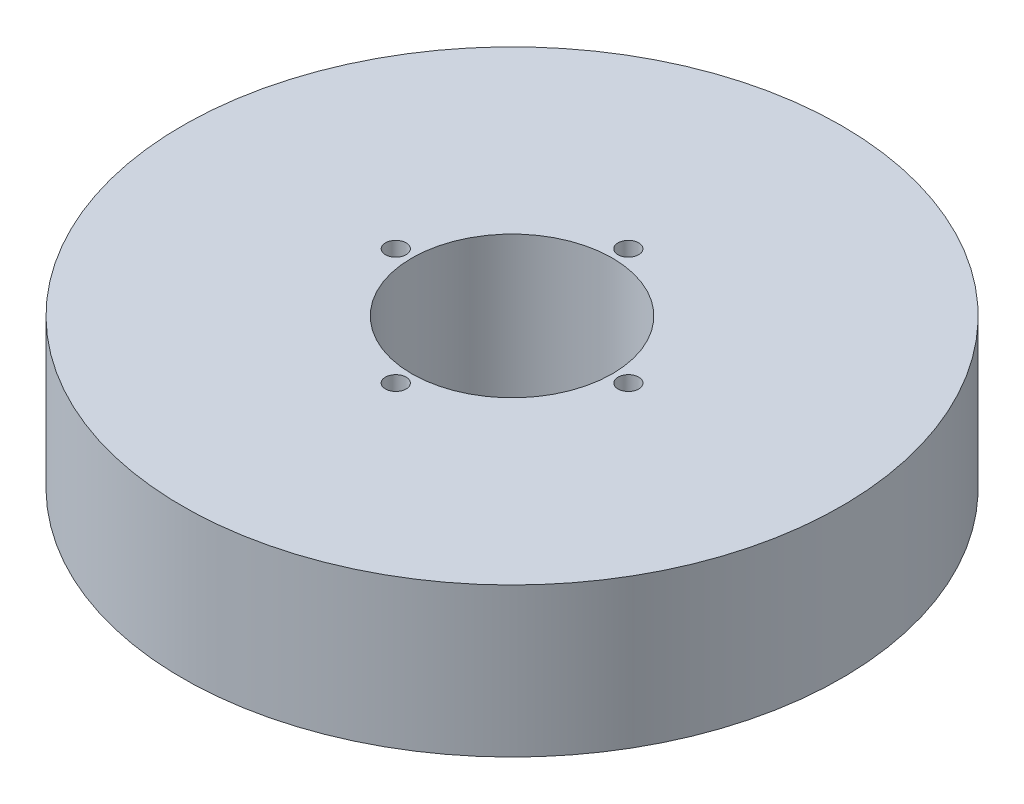
ISO-10303-21;
HEADER;
FILE_DESCRIPTION(('STEP AP214'),'2;1');
FILE_NAME('part.step','',(''),(''),'','','');
FILE_SCHEMA(('AUTOMOTIVE_DESIGN { 1 0 10303 214 1 1 1 1 }'));
ENDSEC;
DATA;
#1=APPLICATION_CONTEXT('core data for automotive mechanical design processes');
#2=APPLICATION_PROTOCOL_DEFINITION('international standard','automotive_design',2000,#1);
#3=PRODUCT_CONTEXT('',#1,'mechanical');
#4=PRODUCT('Part','Part','',(#3));
#5=PRODUCT_RELATED_PRODUCT_CATEGORY('part','',(#4));
#6=PRODUCT_DEFINITION_FORMATION('','',#4);
#7=PRODUCT_DEFINITION_CONTEXT('part definition',#1,'design');
#8=PRODUCT_DEFINITION('design','',#6,#7);
#9=PRODUCT_DEFINITION_SHAPE('','',#8);
#10=(LENGTH_UNIT() NAMED_UNIT(*) SI_UNIT(.MILLI.,.METRE.));
#11=(NAMED_UNIT(*) PLANE_ANGLE_UNIT() SI_UNIT($,.RADIAN.));
#12=(NAMED_UNIT(*) SI_UNIT($,.STERADIAN.) SOLID_ANGLE_UNIT());
#13=UNCERTAINTY_MEASURE_WITH_UNIT(LENGTH_MEASURE(1.E-05),#10,'distance_accuracy_value','');
#14=(GEOMETRIC_REPRESENTATION_CONTEXT(3) GLOBAL_UNCERTAINTY_ASSIGNED_CONTEXT((#13)) GLOBAL_UNIT_ASSIGNED_CONTEXT((#10,
#11,#12)) REPRESENTATION_CONTEXT('',''));
#15=CARTESIAN_POINT('',(0.,0.,0.));
#16=DIRECTION('',(0.,0.,1.));
#17=DIRECTION('',(1.,0.,0.));
#18=AXIS2_PLACEMENT_3D('',#15,#16,#17);
#19=CARTESIAN_POINT('',(0.,26.,0.));
#20=DIRECTION('',(0.,-1.,0.));
#21=DIRECTION('',(0.,0.,-1.));
#22=AXIS2_PLACEMENT_3D('',#19,#20,#21);
#23=CYLINDRICAL_SURFACE('',#22,57.5);
#24=CARTESIAN_POINT('',(0.,26.,0.));
#25=DIRECTION('',(0.,1.,0.));
#26=DIRECTION('',(0.,0.,1.));
#27=AXIS2_PLACEMENT_3D('',#24,#25,#26);
#28=CIRCLE('',#27,57.5);
#29=CARTESIAN_POINT('',(0.,26.,-57.5));
#30=VERTEX_POINT('',#29);
#31=EDGE_CURVE('E10',#30,#30,#28,.T.);
#32=CARTESIAN_POINT('',(0.,0.,0.));
#33=DIRECTION('',(0.,1.,0.));
#34=DIRECTION('',(0.,0.,1.));
#35=AXIS2_PLACEMENT_3D('',#32,#33,#34);
#36=CIRCLE('',#35,57.5);
#37=CARTESIAN_POINT('',(0.,0.,-57.5));
#38=VERTEX_POINT('',#37);
#39=EDGE_CURVE('E37',#38,#38,#36,.T.);
#40=CARTESIAN_POINT('',(0.,26.,-57.5));
#41=CARTESIAN_POINT('',(0.,25.7291666666667,-57.5));
#42=CARTESIAN_POINT('',(0.,25.4583333333333,-57.5));
#43=CARTESIAN_POINT('',(0.,24.9166666666667,-57.5));
#44=CARTESIAN_POINT('',(0.,24.6458333333333,-57.5));
#45=CARTESIAN_POINT('',(0.,24.1041666666667,-57.5));
#46=CARTESIAN_POINT('',(0.,23.8333333333333,-57.5));
#47=CARTESIAN_POINT('',(0.,23.2916666666667,-57.5));
#48=CARTESIAN_POINT('',(0.,23.0208333333333,-57.5));
#49=CARTESIAN_POINT('',(0.,22.4791666666667,-57.5));
#50=CARTESIAN_POINT('',(0.,22.2083333333333,-57.5));
#51=CARTESIAN_POINT('',(0.,21.6666666666667,-57.5));
#52=CARTESIAN_POINT('',(0.,21.3958333333333,-57.5));
#53=CARTESIAN_POINT('',(0.,20.8541666666667,-57.5));
#54=CARTESIAN_POINT('',(0.,20.5833333333333,-57.5));
#55=CARTESIAN_POINT('',(0.,20.0416666666667,-57.5));
#56=CARTESIAN_POINT('',(0.,19.7708333333333,-57.5));
#57=CARTESIAN_POINT('',(0.,19.2291666666667,-57.5));
#58=CARTESIAN_POINT('',(0.,18.9583333333333,-57.5));
#59=CARTESIAN_POINT('',(0.,18.4166666666667,-57.5));
#60=CARTESIAN_POINT('',(0.,18.1458333333333,-57.5));
#61=CARTESIAN_POINT('',(0.,17.6041666666667,-57.5));
#62=CARTESIAN_POINT('',(0.,17.3333333333333,-57.5));
#63=CARTESIAN_POINT('',(0.,16.7916666666667,-57.5));
#64=CARTESIAN_POINT('',(0.,16.5208333333333,-57.5));
#65=CARTESIAN_POINT('',(0.,15.9791666666667,-57.5));
#66=CARTESIAN_POINT('',(0.,15.7083333333333,-57.5));
#67=CARTESIAN_POINT('',(0.,15.1666666666667,-57.5));
#68=CARTESIAN_POINT('',(0.,14.8958333333333,-57.5));
#69=CARTESIAN_POINT('',(0.,14.3541666666667,-57.5));
#70=CARTESIAN_POINT('',(0.,14.0833333333333,-57.5));
#71=CARTESIAN_POINT('',(0.,13.5416666666667,-57.5));
#72=CARTESIAN_POINT('',(0.,13.2708333333333,-57.5));
#73=CARTESIAN_POINT('',(0.,12.7291666666667,-57.5));
#74=CARTESIAN_POINT('',(0.,12.4583333333333,-57.5));
#75=CARTESIAN_POINT('',(0.,11.9166666666667,-57.5));
#76=CARTESIAN_POINT('',(0.,11.6458333333333,-57.5));
#77=CARTESIAN_POINT('',(0.,11.1041666666667,-57.5));
#78=CARTESIAN_POINT('',(0.,10.8333333333333,-57.5));
#79=CARTESIAN_POINT('',(0.,10.2916666666667,-57.5));
#80=CARTESIAN_POINT('',(0.,10.0208333333333,-57.5));
#81=CARTESIAN_POINT('',(0.,9.47916666666667,-57.5));
#82=CARTESIAN_POINT('',(0.,9.20833333333333,-57.5));
#83=CARTESIAN_POINT('',(0.,8.66666666666667,-57.5));
#84=CARTESIAN_POINT('',(0.,8.39583333333333,-57.5));
#85=CARTESIAN_POINT('',(0.,7.85416666666667,-57.5));
#86=CARTESIAN_POINT('',(0.,7.58333333333333,-57.5));
#87=CARTESIAN_POINT('',(0.,7.04166666666667,-57.5));
#88=CARTESIAN_POINT('',(0.,6.77083333333333,-57.5));
#89=CARTESIAN_POINT('',(0.,6.22916666666667,-57.5));
#90=CARTESIAN_POINT('',(0.,5.95833333333333,-57.5));
#91=CARTESIAN_POINT('',(0.,5.41666666666667,-57.5));
#92=CARTESIAN_POINT('',(0.,5.14583333333333,-57.5));
#93=CARTESIAN_POINT('',(0.,4.60416666666667,-57.5));
#94=CARTESIAN_POINT('',(0.,4.33333333333333,-57.5));
#95=CARTESIAN_POINT('',(0.,3.79166666666667,-57.5));
#96=CARTESIAN_POINT('',(0.,3.52083333333333,-57.5));
#97=CARTESIAN_POINT('',(0.,2.97916666666667,-57.5));
#98=CARTESIAN_POINT('',(0.,2.70833333333333,-57.5));
#99=CARTESIAN_POINT('',(0.,2.16666666666667,-57.5));
#100=CARTESIAN_POINT('',(0.,1.89583333333333,-57.5));
#101=CARTESIAN_POINT('',(0.,1.35416666666667,-57.5));
#102=CARTESIAN_POINT('',(0.,1.08333333333333,-57.5));
#103=CARTESIAN_POINT('',(0.,0.541666666666667,-57.5));
#104=CARTESIAN_POINT('',(0.,0.270833333333334,-57.5));
#105=CARTESIAN_POINT('',(0.,0.,-57.5));
#106=B_SPLINE_CURVE_WITH_KNOTS('',3,(#40,#41,#42,#43,#44,#45,#46,#47,#48,#49,#50,#51,#52,#53,
#54,#55,#56,#57,#58,#59,#60,#61,#62,#63,#64,#65,#66,#67,#68,#69,#70,#71,#72,#73,#74,#75,#76,#77,
#78,#79,#80,#81,#82,#83,#84,#85,#86,#87,#88,#89,#90,#91,#92,#93,#94,#95,#96,#97,#98,#99,#100,
#101,#102,#103,#104,#105),.UNSPECIFIED.,.F.,.F.,(4,2,2,2,2,2,2,2,2,2,2,2,2,2,2,2,2,2,2,2,2,2,2,
2,2,2,2,2,2,2,2,2,4),(0.,0.812500000000001,1.625,2.4375,3.25,4.0625,4.875,5.6875,6.5,7.3125,
8.125,8.9375,9.75,10.5625,11.375,12.1875,13.,13.8125,14.625,15.4375,16.25,17.0625,17.875,
18.6875,19.5,20.3125,21.125,21.9375,22.75,23.5625,24.375,25.1875,26.),.UNSPECIFIED.);
#107=EDGE_CURVE('BSEAM40',#30,#38,#106,.T.);
#108=ORIENTED_EDGE('',*,*,#31,.F.);
#109=ORIENTED_EDGE('',*,*,#39,.T.);
#110=ORIENTED_EDGE('',*,*,#107,.T.);
#111=ORIENTED_EDGE('',*,*,#107,.F.);
#112=EDGE_LOOP('',(#108,#110,#109,#111));
#113=FACE_BOUND('',#112,.T.);
#114=ADVANCED_FACE('F40',(#113),#23,.T.);
#115=CARTESIAN_POINT('',(0.,26.,0.));
#116=DIRECTION('',(0.,1.,0.));
#117=DIRECTION('',(0.,0.,1.));
#118=AXIS2_PLACEMENT_3D('',#115,#116,#117);
#119=PLANE('',#118);
#120=CARTESIAN_POINT('',(0.,26.,20.289524759011));
#121=DIRECTION('',(0.,1.,0.));
#122=DIRECTION('',(1.,0.,0.));
#123=AXIS2_PLACEMENT_3D('',#120,#121,#122);
#124=CIRCLE('',#123,1.8036007260813);
#125=CARTESIAN_POINT('',(1.80360072608138,26.,20.289524759011));
#126=VERTEX_POINT('',#125);
#127=EDGE_CURVE('E71',#126,#126,#124,.T.);
#128=ORIENTED_EDGE('',*,*,#127,.F.);
#129=EDGE_LOOP('',(#128));
#130=FACE_BOUND('',#129,.T.);
#131=CARTESIAN_POINT('',(20.289524759011,26.,0.));
#132=DIRECTION('',(0.,1.,0.));
#133=DIRECTION('',(0.,0.,-1.));
#134=AXIS2_PLACEMENT_3D('',#131,#132,#133);
#135=CIRCLE('',#134,1.8036007260813);
#136=CARTESIAN_POINT('',(20.289524759011,26.,-1.8036007260813));
#137=VERTEX_POINT('',#136);
#138=EDGE_CURVE('E70',#137,#137,#135,.T.);
#139=ORIENTED_EDGE('',*,*,#138,.F.);
#140=EDGE_LOOP('',(#139));
#141=FACE_BOUND('',#140,.T.);
#142=CARTESIAN_POINT('',(-2.12521491210248E-13,26.,-20.289524759011));
#143=DIRECTION('',(0.,1.,0.));
#144=DIRECTION('',(-1.,0.,0.));
#145=AXIS2_PLACEMENT_3D('',#142,#143,#144);
#146=CIRCLE('',#145,1.8036007260813);
#147=CARTESIAN_POINT('',(-1.80360072608152,26.,-20.289524759011));
#148=VERTEX_POINT('',#147);
#149=EDGE_CURVE('E61',#148,#148,#146,.T.);
#150=ORIENTED_EDGE('',*,*,#149,.F.);
#151=EDGE_LOOP('',(#150));
#152=FACE_BOUND('',#151,.T.);
#153=CARTESIAN_POINT('',(-20.289524759011,26.,0.));
#154=DIRECTION('',(0.,1.,0.));
#155=DIRECTION('',(0.,0.,1.));
#156=AXIS2_PLACEMENT_3D('',#153,#154,#155);
#157=CIRCLE('',#156,1.8036007260813);
#158=CARTESIAN_POINT('',(-20.289524759011,26.,1.8036007260813));
#159=VERTEX_POINT('',#158);
#160=EDGE_CURVE('E54',#159,#159,#157,.T.);
#161=ORIENTED_EDGE('',*,*,#160,.F.);
#162=EDGE_LOOP('',(#161));
#163=FACE_BOUND('',#162,.T.);
#164=CARTESIAN_POINT('',(0.,26.,0.));
#165=DIRECTION('',(0.,1.,0.));
#166=DIRECTION('',(0.,0.,1.));
#167=AXIS2_PLACEMENT_3D('',#164,#165,#166);
#168=CIRCLE('',#167,17.5);
#169=CARTESIAN_POINT('',(0.,26.,-17.5));
#170=VERTEX_POINT('',#169);
#171=EDGE_CURVE('E50',#170,#170,#168,.T.);
#172=ORIENTED_EDGE('',*,*,#171,.F.);
#173=EDGE_LOOP('',(#172));
#174=FACE_BOUND('',#173,.T.);
#175=ORIENTED_EDGE('',*,*,#31,.T.);
#176=EDGE_LOOP('',(#175));
#177=FACE_BOUND('',#176,.T.);
#178=ADVANCED_FACE('F86',(#130,#141,#152,#163,#174,#177),#119,.T.);
#179=CARTESIAN_POINT('',(0.,0.,0.));
#180=DIRECTION('',(0.,1.,0.));
#181=DIRECTION('',(0.,0.,1.));
#182=AXIS2_PLACEMENT_3D('',#179,#180,#181);
#183=PLANE('',#182);
#184=CARTESIAN_POINT('',(0.,0.,0.));
#185=DIRECTION('',(0.,1.,0.));
#186=DIRECTION('',(0.,0.,1.));
#187=AXIS2_PLACEMENT_3D('',#184,#185,#186);
#188=CIRCLE('',#187,17.5);
#189=CARTESIAN_POINT('',(0.,0.,-17.5));
#190=VERTEX_POINT('',#189);
#191=EDGE_CURVE('E47',#190,#190,#188,.T.);
#192=ORIENTED_EDGE('',*,*,#191,.T.);
#193=EDGE_LOOP('',(#192));
#194=FACE_BOUND('',#193,.T.);
#195=ORIENTED_EDGE('',*,*,#39,.F.);
#196=EDGE_LOOP('',(#195));
#197=FACE_BOUND('',#196,.T.);
#198=ADVANCED_FACE('F93',(#194,#197),#183,.F.);
#199=CARTESIAN_POINT('',(0.,26.,0.));
#200=DIRECTION('',(0.,-1.,0.));
#201=DIRECTION('',(0.,0.,-1.));
#202=AXIS2_PLACEMENT_3D('',#199,#200,#201);
#203=CYLINDRICAL_SURFACE('',#202,17.5);
#204=CARTESIAN_POINT('',(0.,26.,-17.5));
#205=CARTESIAN_POINT('',(0.,25.7291666666667,-17.5));
#206=CARTESIAN_POINT('',(0.,25.4583333333333,-17.5));
#207=CARTESIAN_POINT('',(0.,24.9166666666667,-17.5));
#208=CARTESIAN_POINT('',(0.,24.6458333333333,-17.5));
#209=CARTESIAN_POINT('',(0.,24.1041666666667,-17.5));
#210=CARTESIAN_POINT('',(0.,23.8333333333333,-17.5));
#211=CARTESIAN_POINT('',(0.,23.2916666666667,-17.5));
#212=CARTESIAN_POINT('',(0.,23.0208333333333,-17.5));
#213=CARTESIAN_POINT('',(0.,22.4791666666667,-17.5));
#214=CARTESIAN_POINT('',(0.,22.2083333333333,-17.5));
#215=CARTESIAN_POINT('',(0.,21.6666666666667,-17.5));
#216=CARTESIAN_POINT('',(0.,21.3958333333333,-17.5));
#217=CARTESIAN_POINT('',(0.,20.8541666666667,-17.5));
#218=CARTESIAN_POINT('',(0.,20.5833333333333,-17.5));
#219=CARTESIAN_POINT('',(0.,20.0416666666667,-17.5));
#220=CARTESIAN_POINT('',(0.,19.7708333333333,-17.5));
#221=CARTESIAN_POINT('',(0.,19.2291666666667,-17.5));
#222=CARTESIAN_POINT('',(0.,18.9583333333333,-17.5));
#223=CARTESIAN_POINT('',(0.,18.4166666666667,-17.5));
#224=CARTESIAN_POINT('',(0.,18.1458333333333,-17.5));
#225=CARTESIAN_POINT('',(0.,17.6041666666667,-17.5));
#226=CARTESIAN_POINT('',(0.,17.3333333333333,-17.5));
#227=CARTESIAN_POINT('',(0.,16.7916666666667,-17.5));
#228=CARTESIAN_POINT('',(0.,16.5208333333333,-17.5));
#229=CARTESIAN_POINT('',(0.,15.9791666666667,-17.5));
#230=CARTESIAN_POINT('',(0.,15.7083333333333,-17.5));
#231=CARTESIAN_POINT('',(0.,15.1666666666667,-17.5));
#232=CARTESIAN_POINT('',(0.,14.8958333333333,-17.5));
#233=CARTESIAN_POINT('',(0.,14.3541666666667,-17.5));
#234=CARTESIAN_POINT('',(0.,14.0833333333333,-17.5));
#235=CARTESIAN_POINT('',(0.,13.5416666666667,-17.5));
#236=CARTESIAN_POINT('',(0.,13.2708333333333,-17.5));
#237=CARTESIAN_POINT('',(0.,12.7291666666667,-17.5));
#238=CARTESIAN_POINT('',(0.,12.4583333333333,-17.5));
#239=CARTESIAN_POINT('',(0.,11.9166666666667,-17.5));
#240=CARTESIAN_POINT('',(0.,11.6458333333333,-17.5));
#241=CARTESIAN_POINT('',(0.,11.1041666666667,-17.5));
#242=CARTESIAN_POINT('',(0.,10.8333333333333,-17.5));
#243=CARTESIAN_POINT('',(0.,10.2916666666667,-17.5));
#244=CARTESIAN_POINT('',(0.,10.0208333333333,-17.5));
#245=CARTESIAN_POINT('',(0.,9.47916666666667,-17.5));
#246=CARTESIAN_POINT('',(0.,9.20833333333333,-17.5));
#247=CARTESIAN_POINT('',(0.,8.66666666666667,-17.5));
#248=CARTESIAN_POINT('',(0.,8.39583333333333,-17.5));
#249=CARTESIAN_POINT('',(0.,7.85416666666667,-17.5));
#250=CARTESIAN_POINT('',(0.,7.58333333333333,-17.5));
#251=CARTESIAN_POINT('',(0.,7.04166666666667,-17.5));
#252=CARTESIAN_POINT('',(0.,6.77083333333333,-17.5));
#253=CARTESIAN_POINT('',(0.,6.22916666666667,-17.5));
#254=CARTESIAN_POINT('',(0.,5.95833333333333,-17.5));
#255=CARTESIAN_POINT('',(0.,5.41666666666667,-17.5));
#256=CARTESIAN_POINT('',(0.,5.14583333333333,-17.5));
#257=CARTESIAN_POINT('',(0.,4.60416666666667,-17.5));
#258=CARTESIAN_POINT('',(0.,4.33333333333333,-17.5));
#259=CARTESIAN_POINT('',(0.,3.79166666666667,-17.5));
#260=CARTESIAN_POINT('',(0.,3.52083333333333,-17.5));
#261=CARTESIAN_POINT('',(0.,2.97916666666667,-17.5));
#262=CARTESIAN_POINT('',(0.,2.70833333333333,-17.5));
#263=CARTESIAN_POINT('',(0.,2.16666666666667,-17.5));
#264=CARTESIAN_POINT('',(0.,1.89583333333333,-17.5));
#265=CARTESIAN_POINT('',(0.,1.35416666666667,-17.5));
#266=CARTESIAN_POINT('',(0.,1.08333333333333,-17.5));
#267=CARTESIAN_POINT('',(0.,0.541666666666667,-17.5));
#268=CARTESIAN_POINT('',(0.,0.270833333333334,-17.5));
#269=CARTESIAN_POINT('',(0.,0.,-17.5));
#270=B_SPLINE_CURVE_WITH_KNOTS('',3,(#204,#205,#206,#207,#208,#209,#210,#211,#212,#213,#214,
#215,#216,#217,#218,#219,#220,#221,#222,#223,#224,#225,#226,#227,#228,#229,#230,#231,#232,#233,
#234,#235,#236,#237,#238,#239,#240,#241,#242,#243,#244,#245,#246,#247,#248,#249,#250,#251,#252,
#253,#254,#255,#256,#257,#258,#259,#260,#261,#262,#263,#264,#265,#266,#267,#268,#269),
.UNSPECIFIED.,.F.,.F.,(4,2,2,2,2,2,2,2,2,2,2,2,2,2,2,2,2,2,2,2,2,2,2,2,2,2,2,2,2,2,2,2,4),(0.,
0.812500000000001,1.625,2.4375,3.25,4.0625,4.875,5.6875,6.5,7.3125,8.125,8.9375,9.75,10.5625,
11.375,12.1875,13.,13.8125,14.625,15.4375,16.25,17.0625,17.875,18.6875,19.5,20.3125,21.125,
21.9375,22.75,23.5625,24.375,25.1875,26.),.UNSPECIFIED.);
#271=EDGE_CURVE('BSEAM101',#170,#190,#270,.T.);
#272=ORIENTED_EDGE('',*,*,#171,.T.);
#273=ORIENTED_EDGE('',*,*,#191,.F.);
#274=ORIENTED_EDGE('',*,*,#271,.T.);
#275=ORIENTED_EDGE('',*,*,#271,.F.);
#276=EDGE_LOOP('',(#272,#274,#273,#275));
#277=FACE_BOUND('',#276,.T.);
#278=ADVANCED_FACE('F101',(#277),#203,.F.);
#279=CARTESIAN_POINT('',(-20.289524759011,7.52163568686141,0.));
#280=DIRECTION('',(0.,1.,0.));
#281=DIRECTION('',(0.,0.,1.));
#282=AXIS2_PLACEMENT_3D('',#279,#280,#281);
#283=CYLINDRICAL_SURFACE('',#282,1.8036007260813);
#284=CARTESIAN_POINT('',(-20.289524759011,7.52163568686141,0.));
#285=DIRECTION('',(0.,1.,0.));
#286=DIRECTION('',(0.,0.,1.));
#287=AXIS2_PLACEMENT_3D('',#284,#285,#286);
#288=CIRCLE('',#287,1.8036007260813);
#289=CARTESIAN_POINT('',(-20.289524759011,7.52163568686141,1.8036007260813));
#290=VERTEX_POINT('',#289);
#291=EDGE_CURVE('E55',#290,#290,#288,.T.);
#292=ORIENTED_EDGE('',*,*,#291,.F.);
#293=EDGE_LOOP('',(#292));
#294=FACE_BOUND('',#293,.T.);
#295=ORIENTED_EDGE('',*,*,#160,.T.);
#296=EDGE_LOOP('',(#295));
#297=FACE_BOUND('',#296,.T.);
#298=ADVANCED_FACE('F102',(#294,#297),#283,.F.);
#299=CARTESIAN_POINT('',(-20.289524759011,7.52163568686141,0.));
#300=DIRECTION('',(0.,1.,0.));
#301=DIRECTION('',(0.,0.,1.));
#302=AXIS2_PLACEMENT_3D('',#299,#300,#301);
#303=PLANE('',#302);
#304=ORIENTED_EDGE('',*,*,#291,.T.);
#305=EDGE_LOOP('',(#304));
#306=FACE_BOUND('',#305,.T.);
#307=ADVANCED_FACE('F133',(#306),#303,.T.);
#308=CARTESIAN_POINT('',(-2.12521491210248E-13,7.52163568686141,-20.289524759011));
#309=DIRECTION('',(0.,1.,0.));
#310=DIRECTION('',(0.,0.,1.));
#311=AXIS2_PLACEMENT_3D('',#308,#309,#310);
#312=CYLINDRICAL_SURFACE('',#311,1.8036007260813);
#313=CARTESIAN_POINT('',(-2.12521491210248E-13,7.52163568686141,-20.289524759011));
#314=DIRECTION('',(0.,1.,0.));
#315=DIRECTION('',(-1.,0.,0.));
#316=AXIS2_PLACEMENT_3D('',#313,#314,#315);
#317=CIRCLE('',#316,1.8036007260813);
#318=CARTESIAN_POINT('',(-1.80360072608152,7.52163568686141,-20.289524759011));
#319=VERTEX_POINT('',#318);
#320=EDGE_CURVE('E63',#319,#319,#317,.T.);
#321=ORIENTED_EDGE('',*,*,#320,.F.);
#322=EDGE_LOOP('',(#321));
#323=FACE_BOUND('',#322,.T.);
#324=ORIENTED_EDGE('',*,*,#149,.T.);
#325=EDGE_LOOP('',(#324));
#326=FACE_BOUND('',#325,.T.);
#327=ADVANCED_FACE('F142',(#323,#326),#312,.F.);
#328=CARTESIAN_POINT('',(-2.12521491210248E-13,7.52163568686141,-20.289524759011));
#329=DIRECTION('',(0.,1.,0.));
#330=DIRECTION('',(-1.,0.,0.));
#331=AXIS2_PLACEMENT_3D('',#328,#329,#330);
#332=PLANE('',#331);
#333=ORIENTED_EDGE('',*,*,#320,.T.);
#334=EDGE_LOOP('',(#333));
#335=FACE_BOUND('',#334,.T.);
#336=ADVANCED_FACE('F156',(#335),#332,.T.);
#337=CARTESIAN_POINT('',(20.289524759011,7.52163568686141,0.));
#338=DIRECTION('',(0.,1.,0.));
#339=DIRECTION('',(0.,0.,1.));
#340=AXIS2_PLACEMENT_3D('',#337,#338,#339);
#341=CYLINDRICAL_SURFACE('',#340,1.8036007260813);
#342=CARTESIAN_POINT('',(20.289524759011,7.52163568686141,0.));
#343=DIRECTION('',(0.,1.,0.));
#344=DIRECTION('',(0.,0.,-1.));
#345=AXIS2_PLACEMENT_3D('',#342,#343,#344);
#346=CIRCLE('',#345,1.8036007260813);
#347=CARTESIAN_POINT('',(20.289524759011,7.52163568686141,-1.8036007260813));
#348=VERTEX_POINT('',#347);
#349=EDGE_CURVE('E69',#348,#348,#346,.T.);
#350=ORIENTED_EDGE('',*,*,#349,.F.);
#351=EDGE_LOOP('',(#350));
#352=FACE_BOUND('',#351,.T.);
#353=ORIENTED_EDGE('',*,*,#138,.T.);
#354=EDGE_LOOP('',(#353));
#355=FACE_BOUND('',#354,.T.);
#356=ADVANCED_FACE('F164',(#352,#355),#341,.F.);
#357=CARTESIAN_POINT('',(20.289524759011,7.52163568686141,0.));
#358=DIRECTION('',(0.,1.,0.));
#359=DIRECTION('',(0.,0.,-1.));
#360=AXIS2_PLACEMENT_3D('',#357,#358,#359);
#361=PLANE('',#360);
#362=ORIENTED_EDGE('',*,*,#349,.T.);
#363=EDGE_LOOP('',(#362));
#364=FACE_BOUND('',#363,.T.);
#365=ADVANCED_FACE('F83',(#364),#361,.T.);
#366=CARTESIAN_POINT('',(0.,7.52163568686141,20.289524759011));
#367=DIRECTION('',(0.,1.,0.));
#368=DIRECTION('',(0.,0.,1.));
#369=AXIS2_PLACEMENT_3D('',#366,#367,#368);
#370=CYLINDRICAL_SURFACE('',#369,1.8036007260813);
#371=CARTESIAN_POINT('',(0.,7.52163568686141,20.289524759011));
#372=DIRECTION('',(0.,1.,0.));
#373=DIRECTION('',(1.,0.,0.));
#374=AXIS2_PLACEMENT_3D('',#371,#372,#373);
#375=CIRCLE('',#374,1.8036007260813);
#376=CARTESIAN_POINT('',(1.80360072608138,7.52163568686141,20.289524759011));
#377=VERTEX_POINT('',#376);
#378=EDGE_CURVE('E59',#377,#377,#375,.T.);
#379=ORIENTED_EDGE('',*,*,#378,.F.);
#380=EDGE_LOOP('',(#379));
#381=FACE_BOUND('',#380,.T.);
#382=ORIENTED_EDGE('',*,*,#127,.T.);
#383=EDGE_LOOP('',(#382));
#384=FACE_BOUND('',#383,.T.);
#385=ADVANCED_FACE('F81',(#381,#384),#370,.F.);
#386=CARTESIAN_POINT('',(0.,7.52163568686141,20.289524759011));
#387=DIRECTION('',(0.,1.,0.));
#388=DIRECTION('',(1.,0.,0.));
#389=AXIS2_PLACEMENT_3D('',#386,#387,#388);
#390=PLANE('',#389);
#391=ORIENTED_EDGE('',*,*,#378,.T.);
#392=EDGE_LOOP('',(#391));
#393=FACE_BOUND('',#392,.T.);
#394=ADVANCED_FACE('F78',(#393),#390,.T.);
#395=CLOSED_SHELL('',(#114,#178,#198,#278,#298,#307,#327,#336,#356,#365,#385,#394));
#396=MANIFOLD_SOLID_BREP('B2',#395);
#397=ADVANCED_BREP_SHAPE_REPRESENTATION('',(#18,#396),#14);
#398=SHAPE_DEFINITION_REPRESENTATION(#9,#397);
ENDSEC;
END-ISO-10303-21;
